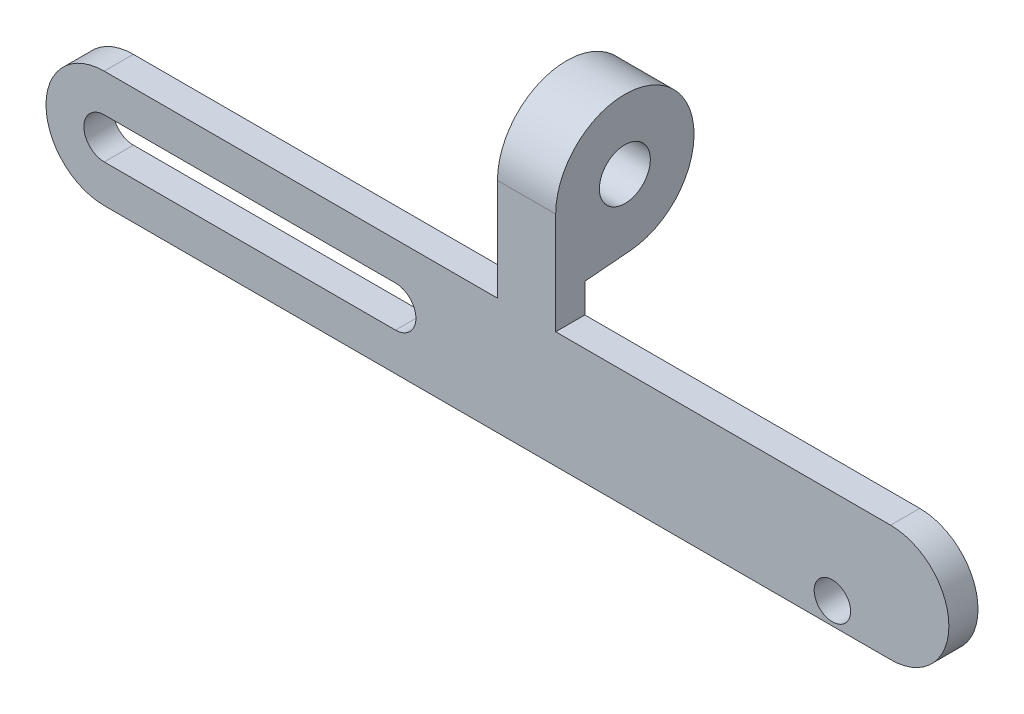
ISO-10303-21;
HEADER;
FILE_DESCRIPTION(('STEP AP214'),'2;1');
FILE_NAME('part.step','',(''),(''),'','','');
FILE_SCHEMA(('AUTOMOTIVE_DESIGN { 1 0 10303 214 1 1 1 1 }'));
ENDSEC;
DATA;
#1=APPLICATION_CONTEXT('core data for automotive mechanical design processes');
#2=APPLICATION_PROTOCOL_DEFINITION('international standard','automotive_design',2000,#1);
#3=PRODUCT_CONTEXT('',#1,'mechanical');
#4=PRODUCT('Part','Part','',(#3));
#5=PRODUCT_RELATED_PRODUCT_CATEGORY('part','',(#4));
#6=PRODUCT_DEFINITION_FORMATION('','',#4);
#7=PRODUCT_DEFINITION_CONTEXT('part definition',#1,'design');
#8=PRODUCT_DEFINITION('design','',#6,#7);
#9=PRODUCT_DEFINITION_SHAPE('','',#8);
#10=(LENGTH_UNIT() NAMED_UNIT(*) SI_UNIT(.MILLI.,.METRE.));
#11=(NAMED_UNIT(*) PLANE_ANGLE_UNIT() SI_UNIT($,.RADIAN.));
#12=(NAMED_UNIT(*) SI_UNIT($,.STERADIAN.) SOLID_ANGLE_UNIT());
#13=UNCERTAINTY_MEASURE_WITH_UNIT(LENGTH_MEASURE(1.E-05),#10,'distance_accuracy_value','');
#14=(GEOMETRIC_REPRESENTATION_CONTEXT(3) GLOBAL_UNCERTAINTY_ASSIGNED_CONTEXT((#13)) GLOBAL_UNIT_ASSIGNED_CONTEXT((#10,
#11,#12)) REPRESENTATION_CONTEXT('',''));
#15=CARTESIAN_POINT('',(0.,0.,0.));
#16=DIRECTION('',(0.,0.,1.));
#17=DIRECTION('',(1.,0.,0.));
#18=AXIS2_PLACEMENT_3D('',#15,#16,#17);
#19=CARTESIAN_POINT('',(-27.,3.99999999999999,2.));
#20=DIRECTION('',(0.,-1.,0.));
#21=DIRECTION('',(1.,0.,0.));
#22=AXIS2_PLACEMENT_3D('',#19,#20,#21);
#23=PLANE('',#22);
#24=DIRECTION('',(0.,0.,-1.));
#25=VECTOR('',#24,1.);
#26=CARTESIAN_POINT('',(4.,3.99999999999999,2.));
#27=LINE('',#26,#25);
#28=CARTESIAN_POINT('',(4.,3.99999999999999,2.));
#29=VERTEX_POINT('',#28);
#30=CARTESIAN_POINT('',(4.,3.99999999999999,0.));
#31=VERTEX_POINT('',#30);
#32=EDGE_CURVE('E143',#29,#31,#27,.T.);
#33=ORIENTED_EDGE('',*,*,#32,.F.);
#34=DIRECTION('',(-1.,0.,0.));
#35=VECTOR('',#34,1.);
#36=CARTESIAN_POINT('',(-27.,3.99999999999999,2.));
#37=LINE('',#36,#35);
#38=CARTESIAN_POINT('',(27.,4.,2.));
#39=VERTEX_POINT('',#38);
#40=EDGE_CURVE('E171',#39,#29,#37,.T.);
#41=ORIENTED_EDGE('',*,*,#40,.F.);
#42=DIRECTION('',(0.,0.,-1.));
#43=VECTOR('',#42,1.);
#44=CARTESIAN_POINT('',(27.,4.,2.));
#45=LINE('',#44,#43);
#46=CARTESIAN_POINT('',(27.,4.,0.));
#47=VERTEX_POINT('',#46);
#48=EDGE_CURVE('E157',#39,#47,#45,.T.);
#49=ORIENTED_EDGE('',*,*,#48,.T.);
#50=DIRECTION('',(-1.,0.,0.));
#51=VECTOR('',#50,1.);
#52=CARTESIAN_POINT('',(-27.,3.99999999999999,0.));
#53=LINE('',#52,#51);
#54=EDGE_CURVE('E137',#47,#31,#53,.T.);
#55=ORIENTED_EDGE('',*,*,#54,.T.);
#56=EDGE_LOOP('',(#33,#41,#49,#55));
#57=FACE_BOUND('',#56,.T.);
#58=ADVANCED_FACE('F33',(#57),#23,.F.);
#59=CARTESIAN_POINT('',(-27.,0.,2.));
#60=DIRECTION('',(0.,0.,1.));
#61=DIRECTION('',(1.,0.,0.));
#62=AXIS2_PLACEMENT_3D('',#59,#60,#61);
#63=PLANE('',#62);
#64=DIRECTION('',(1.,0.,0.));
#65=VECTOR('',#64,1.);
#66=CARTESIAN_POINT('',(-27.,-1.4,2.));
#67=LINE('',#66,#65);
#68=CARTESIAN_POINT('',(-27.,-1.4,2.));
#69=VERTEX_POINT('',#68);
#70=CARTESIAN_POINT('',(-7.,-1.4,2.));
#71=VERTEX_POINT('',#70);
#72=EDGE_CURVE('E216',#69,#71,#67,.T.);
#73=ORIENTED_EDGE('',*,*,#72,.F.);
#74=CARTESIAN_POINT('',(-27.,0.,2.));
#75=DIRECTION('',(0.,0.,1.));
#76=DIRECTION('',(1.,0.,0.));
#77=AXIS2_PLACEMENT_3D('',#74,#75,#76);
#78=CIRCLE('',#77,1.4);
#79=CARTESIAN_POINT('',(-27.,1.4,2.));
#80=VERTEX_POINT('',#79);
#81=EDGE_CURVE('E202',#80,#69,#78,.T.);
#82=ORIENTED_EDGE('',*,*,#81,.F.);
#83=DIRECTION('',(-1.,0.,0.));
#84=VECTOR('',#83,1.);
#85=CARTESIAN_POINT('',(-27.,1.4,2.));
#86=LINE('',#85,#84);
#87=CARTESIAN_POINT('',(-7.,1.4,2.));
#88=VERTEX_POINT('',#87);
#89=EDGE_CURVE('E198',#88,#80,#86,.T.);
#90=ORIENTED_EDGE('',*,*,#89,.F.);
#91=CARTESIAN_POINT('',(-7.,0.,2.));
#92=DIRECTION('',(0.,0.,1.));
#93=DIRECTION('',(1.,0.,0.));
#94=AXIS2_PLACEMENT_3D('',#91,#92,#93);
#95=CIRCLE('',#94,1.4);
#96=EDGE_CURVE('E214',#71,#88,#95,.T.);
#97=ORIENTED_EDGE('',*,*,#96,.F.);
#98=EDGE_LOOP('',(#73,#82,#90,#97));
#99=FACE_BOUND('',#98,.T.);
#100=CARTESIAN_POINT('',(-27.,0.,2.));
#101=DIRECTION('',(0.,0.,1.));
#102=DIRECTION('',(1.,0.,0.));
#103=AXIS2_PLACEMENT_3D('',#100,#101,#102);
#104=CIRCLE('',#103,3.99999999999999);
#105=CARTESIAN_POINT('',(-27.,3.99999999999999,2.));
#106=VERTEX_POINT('',#105);
#107=CARTESIAN_POINT('',(-27.,-3.99999999999999,2.));
#108=VERTEX_POINT('',#107);
#109=EDGE_CURVE('E158',#106,#108,#104,.T.);
#110=ORIENTED_EDGE('',*,*,#109,.T.);
#111=DIRECTION('',(1.,0.,0.));
#112=VECTOR('',#111,1.);
#113=CARTESIAN_POINT('',(-27.,-3.99999999999999,2.));
#114=LINE('',#113,#112);
#115=CARTESIAN_POINT('',(27.,-3.99999999999998,2.));
#116=VERTEX_POINT('',#115);
#117=EDGE_CURVE('E162',#108,#116,#114,.T.);
#118=ORIENTED_EDGE('',*,*,#117,.T.);
#119=CARTESIAN_POINT('',(27.,0.,2.));
#120=DIRECTION('',(0.,0.,1.));
#121=DIRECTION('',(1.,0.,0.));
#122=AXIS2_PLACEMENT_3D('',#119,#120,#121);
#123=CIRCLE('',#122,3.99999999999999);
#124=EDGE_CURVE('E178',#116,#39,#123,.T.);
#125=ORIENTED_EDGE('',*,*,#124,.T.);
#126=ORIENTED_EDGE('',*,*,#40,.T.);
#127=DIRECTION('',(0.,-1.,0.));
#128=VECTOR('',#127,1.);
#129=CARTESIAN_POINT('',(4.,3.99999999999999,2.));
#130=LINE('',#129,#128);
#131=CARTESIAN_POINT('',(4.,11.,2.));
#132=VERTEX_POINT('',#131);
#133=EDGE_CURVE('E149',#132,#29,#130,.T.);
#134=ORIENTED_EDGE('',*,*,#133,.F.);
#135=DIRECTION('',(-1.,0.,0.));
#136=VECTOR('',#135,1.);
#137=CARTESIAN_POINT('',(4.,11.,2.));
#138=LINE('',#137,#136);
#139=CARTESIAN_POINT('',(0.,11.,2.));
#140=VERTEX_POINT('',#139);
#141=EDGE_CURVE('E231',#132,#140,#138,.T.);
#142=ORIENTED_EDGE('',*,*,#141,.T.);
#143=DIRECTION('',(0.,-1.,0.));
#144=VECTOR('',#143,1.);
#145=CARTESIAN_POINT('',(0.,3.99999999999999,2.));
#146=LINE('',#145,#144);
#147=CARTESIAN_POINT('',(0.,3.99999999999999,2.));
#148=VERTEX_POINT('',#147);
#149=EDGE_CURVE('E153',#140,#148,#146,.T.);
#150=ORIENTED_EDGE('',*,*,#149,.T.);
#151=EDGE_CURVE('E187',#148,#106,#37,.T.);
#152=ORIENTED_EDGE('',*,*,#151,.T.);
#153=EDGE_LOOP('',(#110,#118,#125,#126,#134,#142,#150,#152));
#154=FACE_BOUND('',#153,.T.);
#155=CARTESIAN_POINT('',(23.,-2.5,2.));
#156=DIRECTION('',(0.,0.,1.));
#157=DIRECTION('',(1.,0.,0.));
#158=AXIS2_PLACEMENT_3D('',#155,#156,#157);
#159=CIRCLE('',#158,1.25);
#160=CARTESIAN_POINT('',(24.25,-2.5,2.));
#161=VERTEX_POINT('',#160);
#162=EDGE_CURVE('E212',#161,#161,#159,.T.);
#163=ORIENTED_EDGE('',*,*,#162,.F.);
#164=EDGE_LOOP('',(#163));
#165=FACE_BOUND('',#164,.T.);
#166=ADVANCED_FACE('F270',(#99,#154,#165),#63,.T.);
#167=CARTESIAN_POINT('',(-27.,0.,0.));
#168=DIRECTION('',(0.,0.,1.));
#169=DIRECTION('',(1.,0.,0.));
#170=AXIS2_PLACEMENT_3D('',#167,#168,#169);
#171=PLANE('',#170);
#172=CARTESIAN_POINT('',(27.,-2.4,0.));
#173=DIRECTION('',(0.,0.,1.));
#174=DIRECTION('',(1.,0.,0.));
#175=AXIS2_PLACEMENT_3D('',#172,#173,#174);
#176=CIRCLE('',#175,0.750000000000002);
#177=CARTESIAN_POINT('',(27.75,-2.4,0.));
#178=VERTEX_POINT('',#177);
#179=EDGE_CURVE('E37',#178,#178,#176,.T.);
#180=ORIENTED_EDGE('',*,*,#179,.T.);
#181=EDGE_LOOP('',(#180));
#182=FACE_BOUND('',#181,.T.);
#183=CARTESIAN_POINT('',(-27.,0.,0.));
#184=DIRECTION('',(0.,0.,1.));
#185=DIRECTION('',(1.,0.,0.));
#186=AXIS2_PLACEMENT_3D('',#183,#184,#185);
#187=CIRCLE('',#186,3.99999999999999);
#188=CARTESIAN_POINT('',(-27.,3.99999999999999,0.));
#189=VERTEX_POINT('',#188);
#190=CARTESIAN_POINT('',(-27.,-3.99999999999999,0.));
#191=VERTEX_POINT('',#190);
#192=EDGE_CURVE('E181',#189,#191,#187,.T.);
#193=ORIENTED_EDGE('',*,*,#192,.F.);
#194=CARTESIAN_POINT('',(0.,3.99999999999999,0.));
#195=VERTEX_POINT('',#194);
#196=EDGE_CURVE('E159',#195,#189,#53,.T.);
#197=ORIENTED_EDGE('',*,*,#196,.F.);
#198=DIRECTION('',(0.,1.,0.));
#199=VECTOR('',#198,1.);
#200=CARTESIAN_POINT('',(0.,3.99999999999999,0.));
#201=LINE('',#200,#199);
#202=CARTESIAN_POINT('',(0.,5.99999999999999,0.));
#203=VERTEX_POINT('',#202);
#204=EDGE_CURVE('E239',#195,#203,#201,.T.);
#205=ORIENTED_EDGE('',*,*,#204,.T.);
#206=DIRECTION('',(-1.,0.,0.));
#207=VECTOR('',#206,1.);
#208=CARTESIAN_POINT('',(4.,5.99999999999999,0.));
#209=LINE('',#208,#207);
#210=CARTESIAN_POINT('',(4.,5.99999999999999,0.));
#211=VERTEX_POINT('',#210);
#212=EDGE_CURVE('E139',#211,#203,#209,.T.);
#213=ORIENTED_EDGE('',*,*,#212,.F.);
#214=DIRECTION('',(0.,1.,0.));
#215=VECTOR('',#214,1.);
#216=CARTESIAN_POINT('',(4.,3.99999999999999,0.));
#217=LINE('',#216,#215);
#218=EDGE_CURVE('E130',#31,#211,#217,.T.);
#219=ORIENTED_EDGE('',*,*,#218,.F.);
#220=ORIENTED_EDGE('',*,*,#54,.F.);
#221=CARTESIAN_POINT('',(27.,0.,0.));
#222=DIRECTION('',(0.,0.,1.));
#223=DIRECTION('',(1.,0.,0.));
#224=AXIS2_PLACEMENT_3D('',#221,#222,#223);
#225=CIRCLE('',#224,3.99999999999999);
#226=CARTESIAN_POINT('',(27.,-3.99999999999998,0.));
#227=VERTEX_POINT('',#226);
#228=EDGE_CURVE('E164',#227,#47,#225,.T.);
#229=ORIENTED_EDGE('',*,*,#228,.F.);
#230=DIRECTION('',(1.,0.,0.));
#231=VECTOR('',#230,1.);
#232=CARTESIAN_POINT('',(-27.,-3.99999999999999,0.));
#233=LINE('',#232,#231);
#234=EDGE_CURVE('E180',#191,#227,#233,.T.);
#235=ORIENTED_EDGE('',*,*,#234,.F.);
#236=EDGE_LOOP('',(#193,#197,#205,#213,#219,#220,#229,#235));
#237=FACE_BOUND('',#236,.T.);
#238=CARTESIAN_POINT('',(-27.,0.,0.));
#239=DIRECTION('',(0.,0.,1.));
#240=DIRECTION('',(1.,0.,0.));
#241=AXIS2_PLACEMENT_3D('',#238,#239,#240);
#242=CIRCLE('',#241,1.4);
#243=CARTESIAN_POINT('',(-27.,1.4,0.));
#244=VERTEX_POINT('',#243);
#245=CARTESIAN_POINT('',(-27.,-1.4,0.));
#246=VERTEX_POINT('',#245);
#247=EDGE_CURVE('E209',#244,#246,#242,.T.);
#248=ORIENTED_EDGE('',*,*,#247,.T.);
#249=DIRECTION('',(1.,0.,0.));
#250=VECTOR('',#249,1.);
#251=CARTESIAN_POINT('',(-27.,-1.4,0.));
#252=LINE('',#251,#250);
#253=CARTESIAN_POINT('',(-7.,-1.4,0.));
#254=VERTEX_POINT('',#253);
#255=EDGE_CURVE('E206',#246,#254,#252,.T.);
#256=ORIENTED_EDGE('',*,*,#255,.T.);
#257=CARTESIAN_POINT('',(-7.,0.,0.));
#258=DIRECTION('',(0.,0.,1.));
#259=DIRECTION('',(1.,0.,0.));
#260=AXIS2_PLACEMENT_3D('',#257,#258,#259);
#261=CIRCLE('',#260,1.4);
#262=CARTESIAN_POINT('',(-7.,1.4,0.));
#263=VERTEX_POINT('',#262);
#264=EDGE_CURVE('E203',#254,#263,#261,.T.);
#265=ORIENTED_EDGE('',*,*,#264,.T.);
#266=DIRECTION('',(-1.,0.,0.));
#267=VECTOR('',#266,1.);
#268=CARTESIAN_POINT('',(-27.,1.4,0.));
#269=LINE('',#268,#267);
#270=EDGE_CURVE('E199',#263,#244,#269,.T.);
#271=ORIENTED_EDGE('',*,*,#270,.T.);
#272=EDGE_LOOP('',(#248,#256,#265,#271));
#273=FACE_BOUND('',#272,.T.);
#274=CARTESIAN_POINT('',(23.,-2.5,0.));
#275=DIRECTION('',(0.,0.,1.));
#276=DIRECTION('',(1.,0.,0.));
#277=AXIS2_PLACEMENT_3D('',#274,#275,#276);
#278=CIRCLE('',#277,1.25);
#279=CARTESIAN_POINT('',(24.25,-2.5,0.));
#280=VERTEX_POINT('',#279);
#281=EDGE_CURVE('E219',#280,#280,#278,.T.);
#282=ORIENTED_EDGE('',*,*,#281,.T.);
#283=EDGE_LOOP('',(#282));
#284=FACE_BOUND('',#283,.T.);
#285=ADVANCED_FACE('F133',(#182,#237,#273,#284),#171,.F.);
#286=CARTESIAN_POINT('',(-27.,0.,2.));
#287=DIRECTION('',(0.,0.,-1.));
#288=DIRECTION('',(-1.,0.,0.));
#289=AXIS2_PLACEMENT_3D('',#286,#287,#288);
#290=CYLINDRICAL_SURFACE('',#289,3.99999999999999);
#291=ORIENTED_EDGE('',*,*,#192,.T.);
#292=DIRECTION('',(0.,0.,-1.));
#293=VECTOR('',#292,1.);
#294=CARTESIAN_POINT('',(-27.,-3.99999999999999,2.));
#295=LINE('',#294,#293);
#296=EDGE_CURVE('E11',#108,#191,#295,.T.);
#297=ORIENTED_EDGE('',*,*,#296,.F.);
#298=ORIENTED_EDGE('',*,*,#109,.F.);
#299=DIRECTION('',(0.,0.,-1.));
#300=VECTOR('',#299,1.);
#301=CARTESIAN_POINT('',(-27.,3.99999999999999,2.));
#302=LINE('',#301,#300);
#303=EDGE_CURVE('E168',#106,#189,#302,.T.);
#304=ORIENTED_EDGE('',*,*,#303,.T.);
#305=EDGE_LOOP('',(#291,#297,#298,#304));
#306=FACE_BOUND('',#305,.T.);
#307=ADVANCED_FACE('F35',(#306),#290,.T.);
#308=CARTESIAN_POINT('',(-27.,-3.99999999999999,2.));
#309=DIRECTION('',(0.,1.,0.));
#310=DIRECTION('',(-1.,0.,0.));
#311=AXIS2_PLACEMENT_3D('',#308,#309,#310);
#312=PLANE('',#311);
#313=ORIENTED_EDGE('',*,*,#234,.T.);
#314=DIRECTION('',(0.,0.,-1.));
#315=VECTOR('',#314,1.);
#316=CARTESIAN_POINT('',(27.,-3.99999999999998,2.));
#317=LINE('',#316,#315);
#318=EDGE_CURVE('E42',#116,#227,#317,.T.);
#319=ORIENTED_EDGE('',*,*,#318,.F.);
#320=ORIENTED_EDGE('',*,*,#117,.F.);
#321=ORIENTED_EDGE('',*,*,#296,.T.);
#322=EDGE_LOOP('',(#313,#319,#320,#321));
#323=FACE_BOUND('',#322,.T.);
#324=ADVANCED_FACE('F290',(#323),#312,.F.);
#325=CARTESIAN_POINT('',(27.,0.,2.));
#326=DIRECTION('',(0.,0.,-1.));
#327=DIRECTION('',(-1.,0.,0.));
#328=AXIS2_PLACEMENT_3D('',#325,#326,#327);
#329=CYLINDRICAL_SURFACE('',#328,3.99999999999999);
#330=ORIENTED_EDGE('',*,*,#228,.T.);
#331=ORIENTED_EDGE('',*,*,#48,.F.);
#332=ORIENTED_EDGE('',*,*,#124,.F.);
#333=ORIENTED_EDGE('',*,*,#318,.T.);
#334=EDGE_LOOP('',(#330,#331,#332,#333));
#335=FACE_BOUND('',#334,.T.);
#336=ADVANCED_FACE('F177',(#335),#329,.T.);
#337=ORIENTED_EDGE('',*,*,#151,.F.);
#338=DIRECTION('',(0.,0.,-1.));
#339=VECTOR('',#338,1.);
#340=CARTESIAN_POINT('',(0.,3.99999999999999,2.));
#341=LINE('',#340,#339);
#342=EDGE_CURVE('E49',#148,#195,#341,.T.);
#343=ORIENTED_EDGE('',*,*,#342,.T.);
#344=ORIENTED_EDGE('',*,*,#196,.T.);
#345=ORIENTED_EDGE('',*,*,#303,.F.);
#346=EDGE_LOOP('',(#337,#343,#344,#345));
#347=FACE_BOUND('',#346,.T.);
#348=ADVANCED_FACE('F272',(#347),#23,.F.);
#349=CARTESIAN_POINT('',(-27.,0.,2.));
#350=DIRECTION('',(0.,0.,-1.));
#351=DIRECTION('',(-1.,0.,0.));
#352=AXIS2_PLACEMENT_3D('',#349,#350,#351);
#353=CYLINDRICAL_SURFACE('',#352,1.4);
#354=ORIENTED_EDGE('',*,*,#247,.F.);
#355=DIRECTION('',(0.,0.,-1.));
#356=VECTOR('',#355,1.);
#357=CARTESIAN_POINT('',(-27.,1.4,2.));
#358=LINE('',#357,#356);
#359=EDGE_CURVE('E195',#80,#244,#358,.T.);
#360=ORIENTED_EDGE('',*,*,#359,.F.);
#361=ORIENTED_EDGE('',*,*,#81,.T.);
#362=DIRECTION('',(0.,0.,-1.));
#363=VECTOR('',#362,1.);
#364=CARTESIAN_POINT('',(-27.,-1.4,2.));
#365=LINE('',#364,#363);
#366=EDGE_CURVE('E183',#69,#246,#365,.T.);
#367=ORIENTED_EDGE('',*,*,#366,.T.);
#368=EDGE_LOOP('',(#354,#360,#361,#367));
#369=FACE_BOUND('',#368,.T.);
#370=ADVANCED_FACE('F281',(#369),#353,.F.);
#371=CARTESIAN_POINT('',(-27.,-1.4,2.));
#372=DIRECTION('',(0.,1.,0.));
#373=DIRECTION('',(0.,0.,1.));
#374=AXIS2_PLACEMENT_3D('',#371,#372,#373);
#375=PLANE('',#374);
#376=ORIENTED_EDGE('',*,*,#255,.F.);
#377=ORIENTED_EDGE('',*,*,#366,.F.);
#378=ORIENTED_EDGE('',*,*,#72,.T.);
#379=DIRECTION('',(0.,0.,-1.));
#380=VECTOR('',#379,1.);
#381=CARTESIAN_POINT('',(-7.,-1.4,2.));
#382=LINE('',#381,#380);
#383=EDGE_CURVE('E192',#71,#254,#382,.T.);
#384=ORIENTED_EDGE('',*,*,#383,.T.);
#385=EDGE_LOOP('',(#376,#377,#378,#384));
#386=FACE_BOUND('',#385,.T.);
#387=ADVANCED_FACE('F287',(#386),#375,.T.);
#388=CARTESIAN_POINT('',(-7.,0.,2.));
#389=DIRECTION('',(0.,0.,-1.));
#390=DIRECTION('',(-1.,0.,0.));
#391=AXIS2_PLACEMENT_3D('',#388,#389,#390);
#392=CYLINDRICAL_SURFACE('',#391,1.4);
#393=ORIENTED_EDGE('',*,*,#264,.F.);
#394=ORIENTED_EDGE('',*,*,#383,.F.);
#395=ORIENTED_EDGE('',*,*,#96,.T.);
#396=DIRECTION('',(0.,0.,-1.));
#397=VECTOR('',#396,1.);
#398=CARTESIAN_POINT('',(-7.,1.4,2.));
#399=LINE('',#398,#397);
#400=EDGE_CURVE('E57',#88,#263,#399,.T.);
#401=ORIENTED_EDGE('',*,*,#400,.T.);
#402=EDGE_LOOP('',(#393,#394,#395,#401));
#403=FACE_BOUND('',#402,.T.);
#404=ADVANCED_FACE('F324',(#403),#392,.F.);
#405=CARTESIAN_POINT('',(-27.,1.4,2.));
#406=DIRECTION('',(0.,-1.,0.));
#407=DIRECTION('',(0.,0.,-1.));
#408=AXIS2_PLACEMENT_3D('',#405,#406,#407);
#409=PLANE('',#408);
#410=ORIENTED_EDGE('',*,*,#270,.F.);
#411=ORIENTED_EDGE('',*,*,#400,.F.);
#412=ORIENTED_EDGE('',*,*,#89,.T.);
#413=ORIENTED_EDGE('',*,*,#359,.T.);
#414=EDGE_LOOP('',(#410,#411,#412,#413));
#415=FACE_BOUND('',#414,.T.);
#416=ADVANCED_FACE('F320',(#415),#409,.T.);
#417=CARTESIAN_POINT('',(23.,-2.5,2.));
#418=DIRECTION('',(0.,0.,-1.));
#419=DIRECTION('',(-1.,0.,0.));
#420=AXIS2_PLACEMENT_3D('',#417,#418,#419);
#421=CYLINDRICAL_SURFACE('',#420,1.25);
#422=ORIENTED_EDGE('',*,*,#162,.T.);
#423=EDGE_LOOP('',(#422));
#424=FACE_BOUND('',#423,.T.);
#425=ORIENTED_EDGE('',*,*,#281,.F.);
#426=EDGE_LOOP('',(#425));
#427=FACE_BOUND('',#426,.T.);
#428=ADVANCED_FACE('F316',(#424,#427),#421,.F.);
#429=CARTESIAN_POINT('',(27.,-2.4,-3.));
#430=DIRECTION('',(0.,0.,1.));
#431=DIRECTION('',(1.,0.,0.));
#432=AXIS2_PLACEMENT_3D('',#429,#430,#431);
#433=CYLINDRICAL_SURFACE('',#432,0.750000000000002);
#434=CARTESIAN_POINT('',(27.,-2.4,-3.));
#435=DIRECTION('',(0.,0.,1.));
#436=DIRECTION('',(1.,0.,0.));
#437=AXIS2_PLACEMENT_3D('',#434,#435,#436);
#438=CIRCLE('',#437,0.750000000000002);
#439=CARTESIAN_POINT('',(27.75,-2.4,-3.));
#440=VERTEX_POINT('',#439);
#441=EDGE_CURVE('E224',#440,#440,#438,.T.);
#442=ORIENTED_EDGE('',*,*,#441,.T.);
#443=EDGE_LOOP('',(#442));
#444=FACE_BOUND('',#443,.T.);
#445=ORIENTED_EDGE('',*,*,#179,.F.);
#446=EDGE_LOOP('',(#445));
#447=FACE_BOUND('',#446,.T.);
#448=ADVANCED_FACE('F265',(#444,#447),#433,.T.);
#449=CARTESIAN_POINT('',(27.,-2.4,-3.));
#450=DIRECTION('',(0.,0.,1.));
#451=DIRECTION('',(1.,0.,0.));
#452=AXIS2_PLACEMENT_3D('',#449,#450,#451);
#453=PLANE('',#452);
#454=ORIENTED_EDGE('',*,*,#441,.F.);
#455=EDGE_LOOP('',(#454));
#456=FACE_BOUND('',#455,.T.);
#457=ADVANCED_FACE('F257',(#456),#453,.F.);
#458=CARTESIAN_POINT('',(4.,11.,-2.75));
#459=DIRECTION('',(-1.,0.,0.));
#460=DIRECTION('',(0.,0.,1.));
#461=AXIS2_PLACEMENT_3D('',#458,#459,#460);
#462=PLANE('',#461);
#463=ORIENTED_EDGE('',*,*,#32,.T.);
#464=ORIENTED_EDGE('',*,*,#218,.T.);
#465=DIRECTION('',(0.,0.0844188345748017,-0.996430359016139));
#466=VECTOR('',#465,1.);
#467=CARTESIAN_POINT('',(4.,6.26695579467334,-3.1509894642303));
#468=LINE('',#467,#466);
#469=CARTESIAN_POINT('',(4.,6.26695579467334,-3.15098946423029));
#470=VERTEX_POINT('',#469);
#471=EDGE_CURVE('E142',#211,#470,#468,.T.);
#472=ORIENTED_EDGE('',*,*,#471,.T.);
#473=CARTESIAN_POINT('',(4.,11.,-2.75));
#474=DIRECTION('',(1.,0.,0.));
#475=DIRECTION('',(0.,0.,1.));
#476=AXIS2_PLACEMENT_3D('',#473,#474,#475);
#477=CIRCLE('',#476,4.75);
#478=EDGE_CURVE('E244',#470,#132,#477,.T.);
#479=ORIENTED_EDGE('',*,*,#478,.T.);
#480=ORIENTED_EDGE('',*,*,#133,.T.);
#481=EDGE_LOOP('',(#463,#464,#472,#479,#480));
#482=FACE_BOUND('',#481,.T.);
#483=CARTESIAN_POINT('',(4.,11.,-2.75));
#484=DIRECTION('',(1.,0.,0.));
#485=DIRECTION('',(0.,0.,-1.));
#486=AXIS2_PLACEMENT_3D('',#483,#484,#485);
#487=CIRCLE('',#486,1.75);
#488=CARTESIAN_POINT('',(4.,11.,-4.5));
#489=VERTEX_POINT('',#488);
#490=EDGE_CURVE('E242',#489,#489,#487,.T.);
#491=ORIENTED_EDGE('',*,*,#490,.F.);
#492=EDGE_LOOP('',(#491));
#493=FACE_BOUND('',#492,.T.);
#494=ADVANCED_FACE('F146',(#482,#493),#462,.F.);
#495=CARTESIAN_POINT('',(0.,11.,-2.75));
#496=DIRECTION('',(-1.,0.,0.));
#497=DIRECTION('',(0.,0.,1.));
#498=AXIS2_PLACEMENT_3D('',#495,#496,#497);
#499=PLANE('',#498);
#500=ORIENTED_EDGE('',*,*,#342,.F.);
#501=ORIENTED_EDGE('',*,*,#149,.F.);
#502=CARTESIAN_POINT('',(0.,11.,-2.75));
#503=DIRECTION('',(1.,0.,0.));
#504=DIRECTION('',(0.,0.,1.));
#505=AXIS2_PLACEMENT_3D('',#502,#503,#504);
#506=CIRCLE('',#505,4.75);
#507=CARTESIAN_POINT('',(0.,6.26695579467334,-3.15098946423029));
#508=VERTEX_POINT('',#507);
#509=EDGE_CURVE('E235',#508,#140,#506,.T.);
#510=ORIENTED_EDGE('',*,*,#509,.F.);
#511=DIRECTION('',(0.,0.0844188345748017,-0.996430359016139));
#512=VECTOR('',#511,1.);
#513=CARTESIAN_POINT('',(0.,6.26695579467334,-3.1509894642303));
#514=LINE('',#513,#512);
#515=EDGE_CURVE('E237',#203,#508,#514,.T.);
#516=ORIENTED_EDGE('',*,*,#515,.F.);
#517=ORIENTED_EDGE('',*,*,#204,.F.);
#518=EDGE_LOOP('',(#500,#501,#510,#516,#517));
#519=FACE_BOUND('',#518,.T.);
#520=CARTESIAN_POINT('',(0.,11.,-2.75));
#521=DIRECTION('',(1.,0.,0.));
#522=DIRECTION('',(0.,0.,-1.));
#523=AXIS2_PLACEMENT_3D('',#520,#521,#522);
#524=CIRCLE('',#523,1.75);
#525=CARTESIAN_POINT('',(0.,11.,-4.5));
#526=VERTEX_POINT('',#525);
#527=EDGE_CURVE('E247',#526,#526,#524,.T.);
#528=ORIENTED_EDGE('',*,*,#527,.T.);
#529=EDGE_LOOP('',(#528));
#530=FACE_BOUND('',#529,.T.);
#531=ADVANCED_FACE('F256',(#519,#530),#499,.T.);
#532=CARTESIAN_POINT('',(4.,6.26695579467334,-3.1509894642303));
#533=DIRECTION('',(0.,0.996430359016139,0.0844188345748017));
#534=DIRECTION('',(0.,-0.0844188345748017,0.996430359016139));
#535=AXIS2_PLACEMENT_3D('',#532,#533,#534);
#536=PLANE('',#535);
#537=ORIENTED_EDGE('',*,*,#515,.T.);
#538=DIRECTION('',(-1.,0.,0.));
#539=VECTOR('',#538,1.);
#540=CARTESIAN_POINT('',(4.,6.26695579467334,-3.15098946423029));
#541=LINE('',#540,#539);
#542=EDGE_CURVE('E228',#470,#508,#541,.T.);
#543=ORIENTED_EDGE('',*,*,#542,.F.);
#544=ORIENTED_EDGE('',*,*,#471,.F.);
#545=ORIENTED_EDGE('',*,*,#212,.T.);
#546=EDGE_LOOP('',(#537,#543,#544,#545));
#547=FACE_BOUND('',#546,.T.);
#548=ADVANCED_FACE('F263',(#547),#536,.F.);
#549=CARTESIAN_POINT('',(4.,11.,-2.75));
#550=DIRECTION('',(-1.,0.,0.));
#551=DIRECTION('',(0.,0.,1.));
#552=AXIS2_PLACEMENT_3D('',#549,#550,#551);
#553=CYLINDRICAL_SURFACE('',#552,4.75);
#554=ORIENTED_EDGE('',*,*,#509,.T.);
#555=ORIENTED_EDGE('',*,*,#141,.F.);
#556=ORIENTED_EDGE('',*,*,#478,.F.);
#557=ORIENTED_EDGE('',*,*,#542,.T.);
#558=EDGE_LOOP('',(#554,#555,#556,#557));
#559=FACE_BOUND('',#558,.T.);
#560=ADVANCED_FACE('F303',(#559),#553,.T.);
#561=CARTESIAN_POINT('',(4.,11.,-2.75));
#562=DIRECTION('',(-1.,0.,0.));
#563=DIRECTION('',(0.,0.,1.));
#564=AXIS2_PLACEMENT_3D('',#561,#562,#563);
#565=CYLINDRICAL_SURFACE('',#564,1.75);
#566=ORIENTED_EDGE('',*,*,#490,.T.);
#567=EDGE_LOOP('',(#566));
#568=FACE_BOUND('',#567,.T.);
#569=ORIENTED_EDGE('',*,*,#527,.F.);
#570=EDGE_LOOP('',(#569));
#571=FACE_BOUND('',#570,.T.);
#572=ADVANCED_FACE('F253',(#568,#571),#565,.F.);
#573=CLOSED_SHELL('',(#58,#166,#285,#307,#324,#336,#348,#370,#387,#404,#416,#428,#448,#457,#494,
#531,#548,#560,#572));
#574=MANIFOLD_SOLID_BREP('B2',#573);
#575=ADVANCED_BREP_SHAPE_REPRESENTATION('',(#18,#574),#14);
#576=SHAPE_DEFINITION_REPRESENTATION(#9,#575);
ENDSEC;
END-ISO-10303-21;
